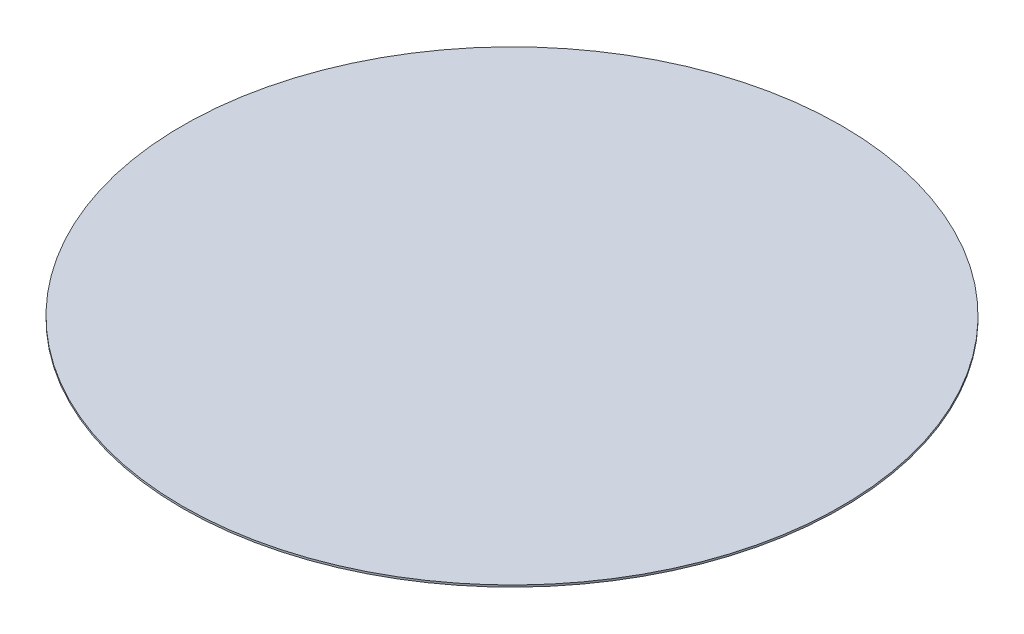
ISO-10303-21;
HEADER;
FILE_DESCRIPTION(('STEP AP214'),'2;1');
FILE_NAME('part.step','',(''),(''),'','','');
FILE_SCHEMA(('AUTOMOTIVE_DESIGN { 1 0 10303 214 1 1 1 1 }'));
ENDSEC;
DATA;
#1=APPLICATION_CONTEXT('core data for automotive mechanical design processes');
#2=APPLICATION_PROTOCOL_DEFINITION('international standard','automotive_design',2000,#1);
#3=PRODUCT_CONTEXT('',#1,'mechanical');
#4=PRODUCT('Part','Part','',(#3));
#5=PRODUCT_RELATED_PRODUCT_CATEGORY('part','',(#4));
#6=PRODUCT_DEFINITION_FORMATION('','',#4);
#7=PRODUCT_DEFINITION_CONTEXT('part definition',#1,'design');
#8=PRODUCT_DEFINITION('design','',#6,#7);
#9=PRODUCT_DEFINITION_SHAPE('','',#8);
#10=(LENGTH_UNIT() NAMED_UNIT(*) SI_UNIT(.MILLI.,.METRE.));
#11=(NAMED_UNIT(*) PLANE_ANGLE_UNIT() SI_UNIT($,.RADIAN.));
#12=(NAMED_UNIT(*) SI_UNIT($,.STERADIAN.) SOLID_ANGLE_UNIT());
#13=UNCERTAINTY_MEASURE_WITH_UNIT(LENGTH_MEASURE(1.E-05),#10,'distance_accuracy_value','');
#14=(GEOMETRIC_REPRESENTATION_CONTEXT(3) GLOBAL_UNCERTAINTY_ASSIGNED_CONTEXT((#13)) GLOBAL_UNIT_ASSIGNED_CONTEXT((#10,
#11,#12)) REPRESENTATION_CONTEXT('',''));
#15=CARTESIAN_POINT('',(0.,0.,0.));
#16=DIRECTION('',(0.,0.,1.));
#17=DIRECTION('',(1.,0.,0.));
#18=AXIS2_PLACEMENT_3D('',#15,#16,#17);
#19=CARTESIAN_POINT('',(0.,1.,0.));
#20=DIRECTION('',(0.,-1.,0.));
#21=DIRECTION('',(0.,0.,-1.));
#22=AXIS2_PLACEMENT_3D('',#19,#20,#21);
#23=CYLINDRICAL_SURFACE('',#22,175.);
#24=CARTESIAN_POINT('',(0.,1.,0.));
#25=DIRECTION('',(0.,1.,0.));
#26=DIRECTION('',(0.,0.,1.));
#27=AXIS2_PLACEMENT_3D('',#24,#25,#26);
#28=CIRCLE('',#27,175.);
#29=CARTESIAN_POINT('',(0.,1.,175.));
#30=VERTEX_POINT('',#29);
#31=EDGE_CURVE('E10',#30,#30,#28,.T.);
#32=ORIENTED_EDGE('',*,*,#31,.F.);
#33=EDGE_LOOP('',(#32));
#34=FACE_BOUND('',#33,.T.);
#35=CARTESIAN_POINT('',(0.,0.,0.));
#36=DIRECTION('',(0.,1.,0.));
#37=DIRECTION('',(0.,0.,1.));
#38=AXIS2_PLACEMENT_3D('',#35,#36,#37);
#39=CIRCLE('',#38,175.);
#40=CARTESIAN_POINT('',(0.,0.,175.));
#41=VERTEX_POINT('',#40);
#42=EDGE_CURVE('E38',#41,#41,#39,.T.);
#43=ORIENTED_EDGE('',*,*,#42,.T.);
#44=EDGE_LOOP('',(#43));
#45=FACE_BOUND('',#44,.T.);
#46=ADVANCED_FACE('F35',(#34,#45),#23,.T.);
#47=CARTESIAN_POINT('',(0.,1.,0.));
#48=DIRECTION('',(0.,1.,0.));
#49=DIRECTION('',(0.,0.,1.));
#50=AXIS2_PLACEMENT_3D('',#47,#48,#49);
#51=PLANE('',#50);
#52=ORIENTED_EDGE('',*,*,#31,.T.);
#53=EDGE_LOOP('',(#52));
#54=FACE_BOUND('',#53,.T.);
#55=ADVANCED_FACE('F50',(#54),#51,.T.);
#56=CARTESIAN_POINT('',(0.,0.,0.));
#57=DIRECTION('',(0.,1.,0.));
#58=DIRECTION('',(0.,0.,1.));
#59=AXIS2_PLACEMENT_3D('',#56,#57,#58);
#60=PLANE('',#59);
#61=ORIENTED_EDGE('',*,*,#42,.F.);
#62=EDGE_LOOP('',(#61));
#63=FACE_BOUND('',#62,.T.);
#64=ADVANCED_FACE('F48',(#63),#60,.F.);
#65=CLOSED_SHELL('',(#46,#55,#64));
#66=MANIFOLD_SOLID_BREP('B2',#65);
#67=ADVANCED_BREP_SHAPE_REPRESENTATION('',(#18,#66),#14);
#68=SHAPE_DEFINITION_REPRESENTATION(#9,#67);
ENDSEC;
END-ISO-10303-21;
